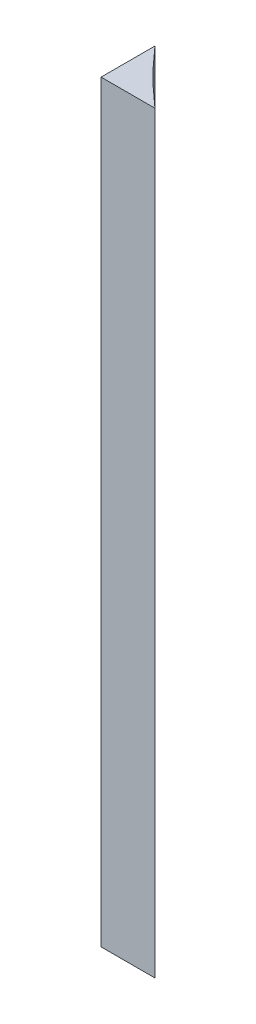
ISO-10303-21;
HEADER;
FILE_DESCRIPTION(('STEP AP214'),'2;1');
FILE_NAME('part.step','',(''),(''),'','','');
FILE_SCHEMA(('AUTOMOTIVE_DESIGN { 1 0 10303 214 1 1 1 1 }'));
ENDSEC;
DATA;
#1=APPLICATION_CONTEXT('core data for automotive mechanical design processes');
#2=APPLICATION_PROTOCOL_DEFINITION('international standard','automotive_design',2000,#1);
#3=PRODUCT_CONTEXT('',#1,'mechanical');
#4=PRODUCT('Part','Part','',(#3));
#5=PRODUCT_RELATED_PRODUCT_CATEGORY('part','',(#4));
#6=PRODUCT_DEFINITION_FORMATION('','',#4);
#7=PRODUCT_DEFINITION_CONTEXT('part definition',#1,'design');
#8=PRODUCT_DEFINITION('design','',#6,#7);
#9=PRODUCT_DEFINITION_SHAPE('','',#8);
#10=(LENGTH_UNIT() NAMED_UNIT(*) SI_UNIT(.MILLI.,.METRE.));
#11=(NAMED_UNIT(*) PLANE_ANGLE_UNIT() SI_UNIT($,.RADIAN.));
#12=(NAMED_UNIT(*) SI_UNIT($,.STERADIAN.) SOLID_ANGLE_UNIT());
#13=UNCERTAINTY_MEASURE_WITH_UNIT(LENGTH_MEASURE(1.E-05),#10,'distance_accuracy_value','');
#14=(GEOMETRIC_REPRESENTATION_CONTEXT(3) GLOBAL_UNCERTAINTY_ASSIGNED_CONTEXT((#13)) GLOBAL_UNIT_ASSIGNED_CONTEXT((#10,
#11,#12)) REPRESENTATION_CONTEXT('',''));
#15=CARTESIAN_POINT('',(0.,0.,0.));
#16=DIRECTION('',(0.,0.,1.));
#17=DIRECTION('',(1.,0.,0.));
#18=AXIS2_PLACEMENT_3D('',#15,#16,#17);
#19=CARTESIAN_POINT('',(1535.,65.0000000000002,-250.));
#20=DIRECTION('',(-1.,0.,0.));
#21=DIRECTION('',(0.,0.,1.));
#22=AXIS2_PLACEMENT_3D('',#19,#20,#21);
#23=PLANE('',#22);
#24=DIRECTION('',(0.,-1.,0.));
#25=VECTOR('',#24,1.);
#26=CARTESIAN_POINT('',(1535.,65.0000000000002,-250.));
#27=LINE('',#26,#25);
#28=CARTESIAN_POINT('',(1535.,64.8000000000002,-250.));
#29=VERTEX_POINT('',#28);
#30=CARTESIAN_POINT('',(1535.,-74.9999999999999,-250.));
#31=VERTEX_POINT('',#30);
#32=EDGE_CURVE('E87',#29,#31,#27,.T.);
#33=ORIENTED_EDGE('',*,*,#32,.F.);
#34=DIRECTION('',(0.,0.,1.));
#35=VECTOR('',#34,1.);
#36=CARTESIAN_POINT('',(1535.,64.8000000000002,-250.));
#37=LINE('',#36,#35);
#38=CARTESIAN_POINT('',(1535.,64.7999999999998,-260.));
#39=VERTEX_POINT('',#38);
#40=EDGE_CURVE('E90',#39,#29,#37,.T.);
#41=ORIENTED_EDGE('',*,*,#40,.F.);
#42=DIRECTION('',(0.,-1.,0.));
#43=VECTOR('',#42,1.);
#44=CARTESIAN_POINT('',(1535.,64.8000000000002,-260.));
#45=LINE('',#44,#43);
#46=CARTESIAN_POINT('',(1535.,-75.0000000000004,-259.999999999997));
#47=VERTEX_POINT('',#46);
#48=EDGE_CURVE('E61',#47,#39,#45,.F.);
#49=ORIENTED_EDGE('',*,*,#48,.F.);
#50=DIRECTION('',(0.,0.,1.));
#51=VECTOR('',#50,1.);
#52=CARTESIAN_POINT('',(1535.,-74.9999999999999,-250.));
#53=LINE('',#52,#51);
#54=EDGE_CURVE('E107',#47,#31,#53,.T.);
#55=ORIENTED_EDGE('',*,*,#54,.T.);
#56=EDGE_LOOP('',(#33,#41,#49,#55));
#57=FACE_BOUND('',#56,.T.);
#58=ADVANCED_FACE('F57',(#57),#23,.T.);
#59=CARTESIAN_POINT('',(1610.62228977097,-74.9999999999999,-325.622289770974));
#60=DIRECTION('',(0.,1.,0.));
#61=DIRECTION('',(0.,0.,1.));
#62=AXIS2_PLACEMENT_3D('',#59,#60,#61);
#63=PLANE('',#62);
#64=DIRECTION('',(1.,0.,0.));
#65=VECTOR('',#64,1.);
#66=CARTESIAN_POINT('',(1550.,-74.9999999999999,-250.));
#67=LINE('',#66,#65);
#68=CARTESIAN_POINT('',(1545.,-75.0000000000005,-249.999999999999));
#69=VERTEX_POINT('',#68);
#70=EDGE_CURVE('E106',#31,#69,#67,.T.);
#71=ORIENTED_EDGE('',*,*,#70,.F.);
#72=ORIENTED_EDGE('',*,*,#54,.F.);
#73=CARTESIAN_POINT('',(1610.62228977098,-75.000000000002,-325.622289770979));
#74=DIRECTION('',(0.,-1.,0.));
#75=DIRECTION('',(1.,0.,0.));
#76=AXIS2_PLACEMENT_3D('',#73,#74,#75);
#77=CIRCLE('',#76,100.124999999964);
#78=EDGE_CURVE('E100',#69,#47,#77,.T.);
#79=ORIENTED_EDGE('',*,*,#78,.F.);
#80=EDGE_LOOP('',(#71,#72,#79));
#81=FACE_BOUND('',#80,.T.);
#82=ADVANCED_FACE('F123',(#81),#63,.F.);
#83=CARTESIAN_POINT('',(1550.,-75.,-250.));
#84=DIRECTION('',(0.,0.,-1.));
#85=DIRECTION('',(-1.,0.,0.));
#86=AXIS2_PLACEMENT_3D('',#83,#84,#85);
#87=PLANE('',#86);
#88=DIRECTION('',(0.,-1.,0.));
#89=VECTOR('',#88,1.);
#90=CARTESIAN_POINT('',(1545.,64.8000000000002,-250.));
#91=LINE('',#90,#89);
#92=CARTESIAN_POINT('',(1545.,64.7999999999997,-250.));
#93=VERTEX_POINT('',#92);
#94=EDGE_CURVE('E67',#93,#69,#91,.T.);
#95=ORIENTED_EDGE('',*,*,#94,.F.);
#96=DIRECTION('',(-1.,0.,0.));
#97=VECTOR('',#96,1.);
#98=CARTESIAN_POINT('',(1750.,64.8000000000002,-250.));
#99=LINE('',#98,#97);
#100=EDGE_CURVE('E94',#93,#29,#99,.T.);
#101=ORIENTED_EDGE('',*,*,#100,.T.);
#102=ORIENTED_EDGE('',*,*,#32,.T.);
#103=ORIENTED_EDGE('',*,*,#70,.T.);
#104=EDGE_LOOP('',(#95,#101,#102,#103));
#105=FACE_BOUND('',#104,.T.);
#106=ADVANCED_FACE('F120',(#105),#87,.F.);
#107=CARTESIAN_POINT('',(1610.62228977097,64.800000000003,-325.622289770974));
#108=DIRECTION('',(0.,1.,0.));
#109=DIRECTION('',(0.,0.,1.));
#110=AXIS2_PLACEMENT_3D('',#107,#108,#109);
#111=PLANE('',#110);
#112=ORIENTED_EDGE('',*,*,#100,.F.);
#113=CARTESIAN_POINT('',(1610.62228977098,64.7999999999981,-325.622289770981));
#114=DIRECTION('',(0.,-1.,0.));
#115=DIRECTION('',(1.,0.,0.));
#116=AXIS2_PLACEMENT_3D('',#113,#114,#115);
#117=CIRCLE('',#116,100.124999999964);
#118=EDGE_CURVE('E12',#39,#93,#117,.F.);
#119=ORIENTED_EDGE('',*,*,#118,.F.);
#120=ORIENTED_EDGE('',*,*,#40,.T.);
#121=EDGE_LOOP('',(#112,#119,#120));
#122=FACE_BOUND('',#121,.T.);
#123=ADVANCED_FACE('F96',(#122),#111,.T.);
#124=CARTESIAN_POINT('',(1610.62228977098,64.7999999999981,-325.622289770981));
#125=DIRECTION('',(0.,-1.,0.));
#126=DIRECTION('',(1.,0.,0.));
#127=AXIS2_PLACEMENT_3D('',#124,#125,#126);
#128=CYLINDRICAL_SURFACE('',#127,100.124999999964);
#129=ORIENTED_EDGE('',*,*,#118,.T.);
#130=ORIENTED_EDGE('',*,*,#94,.T.);
#131=ORIENTED_EDGE('',*,*,#78,.T.);
#132=ORIENTED_EDGE('',*,*,#48,.T.);
#133=EDGE_LOOP('',(#129,#130,#131,#132));
#134=FACE_BOUND('',#133,.T.);
#135=ADVANCED_FACE('F59',(#134),#128,.F.);
#136=CLOSED_SHELL('',(#58,#82,#106,#123,#135));
#137=MANIFOLD_SOLID_BREP('B2',#136);
#138=ADVANCED_BREP_SHAPE_REPRESENTATION('',(#18,#137),#14);
#139=SHAPE_DEFINITION_REPRESENTATION(#9,#138);
ENDSEC;
END-ISO-10303-21;
